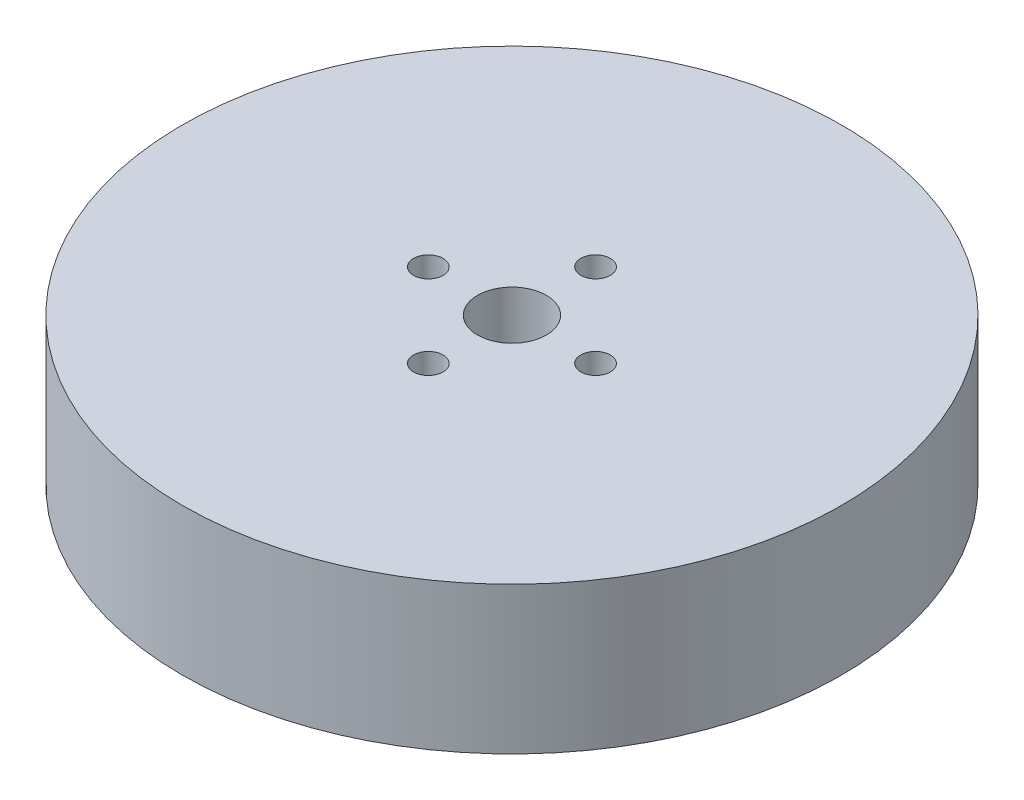
ISO-10303-21;
HEADER;
FILE_DESCRIPTION(('STEP AP214'),'2;1');
FILE_NAME('part.step','',(''),(''),'','','');
FILE_SCHEMA(('AUTOMOTIVE_DESIGN { 1 0 10303 214 1 1 1 1 }'));
ENDSEC;
DATA;
#1=APPLICATION_CONTEXT('core data for automotive mechanical design processes');
#2=APPLICATION_PROTOCOL_DEFINITION('international standard','automotive_design',2000,#1);
#3=PRODUCT_CONTEXT('',#1,'mechanical');
#4=PRODUCT('Part','Part','',(#3));
#5=PRODUCT_RELATED_PRODUCT_CATEGORY('part','',(#4));
#6=PRODUCT_DEFINITION_FORMATION('','',#4);
#7=PRODUCT_DEFINITION_CONTEXT('part definition',#1,'design');
#8=PRODUCT_DEFINITION('design','',#6,#7);
#9=PRODUCT_DEFINITION_SHAPE('','',#8);
#10=(LENGTH_UNIT() NAMED_UNIT(*) SI_UNIT(.MILLI.,.METRE.));
#11=(NAMED_UNIT(*) PLANE_ANGLE_UNIT() SI_UNIT($,.RADIAN.));
#12=(NAMED_UNIT(*) SI_UNIT($,.STERADIAN.) SOLID_ANGLE_UNIT());
#13=UNCERTAINTY_MEASURE_WITH_UNIT(LENGTH_MEASURE(1.E-05),#10,'distance_accuracy_value','');
#14=(GEOMETRIC_REPRESENTATION_CONTEXT(3) GLOBAL_UNCERTAINTY_ASSIGNED_CONTEXT((#13)) GLOBAL_UNIT_ASSIGNED_CONTEXT((#10,
#11,#12)) REPRESENTATION_CONTEXT('',''));
#15=CARTESIAN_POINT('',(0.,0.,0.));
#16=DIRECTION('',(0.,0.,1.));
#17=DIRECTION('',(1.,0.,0.));
#18=AXIS2_PLACEMENT_3D('',#15,#16,#17);
#19=CARTESIAN_POINT('',(0.,17.,0.));
#20=DIRECTION('',(0.,1.,0.));
#21=DIRECTION('',(0.,0.,1.));
#22=AXIS2_PLACEMENT_3D('',#19,#20,#21);
#23=PLANE('',#22);
#24=CARTESIAN_POINT('',(0.,17.,8.5));
#25=DIRECTION('',(0.,1.,0.));
#26=DIRECTION('',(0.,0.,1.));
#27=AXIS2_PLACEMENT_3D('',#24,#25,#26);
#28=CIRCLE('',#27,1.5);
#29=CARTESIAN_POINT('',(0.,17.,10.));
#30=VERTEX_POINT('',#29);
#31=EDGE_CURVE('E55',#30,#30,#28,.F.);
#32=ORIENTED_EDGE('',*,*,#31,.T.);
#33=EDGE_LOOP('',(#32));
#34=FACE_BOUND('',#33,.T.);
#35=CARTESIAN_POINT('',(8.5,17.,0.));
#36=DIRECTION('',(0.,1.,0.));
#37=DIRECTION('',(0.,0.,1.));
#38=AXIS2_PLACEMENT_3D('',#35,#36,#37);
#39=CIRCLE('',#38,1.5);
#40=CARTESIAN_POINT('',(8.5,17.,1.5));
#41=VERTEX_POINT('',#40);
#42=EDGE_CURVE('E63',#41,#41,#39,.F.);
#43=ORIENTED_EDGE('',*,*,#42,.T.);
#44=EDGE_LOOP('',(#43));
#45=FACE_BOUND('',#44,.T.);
#46=CARTESIAN_POINT('',(0.,17.,0.));
#47=DIRECTION('',(0.,1.,0.));
#48=DIRECTION('',(0.,0.,1.));
#49=AXIS2_PLACEMENT_3D('',#46,#47,#48);
#50=CIRCLE('',#49,33.5);
#51=CARTESIAN_POINT('',(0.,17.,33.5));
#52=VERTEX_POINT('',#51);
#53=EDGE_CURVE('E41',#52,#52,#50,.T.);
#54=ORIENTED_EDGE('',*,*,#53,.T.);
#55=EDGE_LOOP('',(#54));
#56=FACE_BOUND('',#55,.T.);
#57=CARTESIAN_POINT('',(0.,17.,0.));
#58=DIRECTION('',(0.,1.,0.));
#59=DIRECTION('',(0.,0.,1.));
#60=AXIS2_PLACEMENT_3D('',#57,#58,#59);
#61=CIRCLE('',#60,3.5);
#62=CARTESIAN_POINT('',(0.,17.,3.5));
#63=VERTEX_POINT('',#62);
#64=EDGE_CURVE('E45',#63,#63,#61,.F.);
#65=ORIENTED_EDGE('',*,*,#64,.T.);
#66=EDGE_LOOP('',(#65));
#67=FACE_BOUND('',#66,.T.);
#68=CARTESIAN_POINT('',(-8.5,17.,0.));
#69=DIRECTION('',(0.,1.,0.));
#70=DIRECTION('',(0.,0.,1.));
#71=AXIS2_PLACEMENT_3D('',#68,#69,#70);
#72=CIRCLE('',#71,1.5);
#73=CARTESIAN_POINT('',(-8.5,17.,1.50000000000001));
#74=VERTEX_POINT('',#73);
#75=EDGE_CURVE('E59',#74,#74,#72,.F.);
#76=ORIENTED_EDGE('',*,*,#75,.T.);
#77=EDGE_LOOP('',(#76));
#78=FACE_BOUND('',#77,.T.);
#79=CARTESIAN_POINT('',(0.,17.,-8.5));
#80=DIRECTION('',(0.,1.,0.));
#81=DIRECTION('',(0.,0.,1.));
#82=AXIS2_PLACEMENT_3D('',#79,#80,#81);
#83=CIRCLE('',#82,1.5);
#84=CARTESIAN_POINT('',(0.,17.,-7.));
#85=VERTEX_POINT('',#84);
#86=EDGE_CURVE('E51',#85,#85,#83,.F.);
#87=ORIENTED_EDGE('',*,*,#86,.T.);
#88=EDGE_LOOP('',(#87));
#89=FACE_BOUND('',#88,.T.);
#90=ADVANCED_FACE('F30',(#34,#45,#56,#67,#78,#89),#23,.T.);
#91=CARTESIAN_POINT('',(0.,0.,0.));
#92=DIRECTION('',(0.,1.,0.));
#93=DIRECTION('',(0.,0.,1.));
#94=AXIS2_PLACEMENT_3D('',#91,#92,#93);
#95=PLANE('',#94);
#96=CARTESIAN_POINT('',(0.,0.,0.));
#97=DIRECTION('',(0.,1.,0.));
#98=DIRECTION('',(0.,0.,1.));
#99=AXIS2_PLACEMENT_3D('',#96,#97,#98);
#100=CIRCLE('',#99,20.4999999999997);
#101=CARTESIAN_POINT('',(0.,0.,20.4999999999997));
#102=VERTEX_POINT('',#101);
#103=EDGE_CURVE('E10',#102,#102,#100,.F.);
#104=ORIENTED_EDGE('',*,*,#103,.T.);
#105=EDGE_LOOP('',(#104));
#106=FACE_BOUND('',#105,.T.);
#107=CARTESIAN_POINT('',(0.,0.,8.5));
#108=DIRECTION('',(0.,1.,0.));
#109=DIRECTION('',(0.,0.,1.));
#110=AXIS2_PLACEMENT_3D('',#107,#108,#109);
#111=CIRCLE('',#110,1.5);
#112=CARTESIAN_POINT('',(0.,0.,10.));
#113=VERTEX_POINT('',#112);
#114=EDGE_CURVE('E52',#113,#113,#111,.F.);
#115=ORIENTED_EDGE('',*,*,#114,.F.);
#116=EDGE_LOOP('',(#115));
#117=FACE_BOUND('',#116,.T.);
#118=CARTESIAN_POINT('',(8.5,0.,0.));
#119=DIRECTION('',(0.,1.,0.));
#120=DIRECTION('',(0.,0.,1.));
#121=AXIS2_PLACEMENT_3D('',#118,#119,#120);
#122=CIRCLE('',#121,1.5);
#123=CARTESIAN_POINT('',(8.5,0.,1.5));
#124=VERTEX_POINT('',#123);
#125=EDGE_CURVE('E60',#124,#124,#122,.F.);
#126=ORIENTED_EDGE('',*,*,#125,.F.);
#127=EDGE_LOOP('',(#126));
#128=FACE_BOUND('',#127,.T.);
#129=CARTESIAN_POINT('',(0.,0.,0.));
#130=DIRECTION('',(0.,1.,0.));
#131=DIRECTION('',(0.,0.,1.));
#132=AXIS2_PLACEMENT_3D('',#129,#130,#131);
#133=CIRCLE('',#132,3.5);
#134=CARTESIAN_POINT('',(0.,0.,3.5));
#135=VERTEX_POINT('',#134);
#136=EDGE_CURVE('E64',#135,#135,#133,.F.);
#137=ORIENTED_EDGE('',*,*,#136,.F.);
#138=EDGE_LOOP('',(#137));
#139=FACE_BOUND('',#138,.T.);
#140=CARTESIAN_POINT('',(-8.5,0.,0.));
#141=DIRECTION('',(0.,1.,0.));
#142=DIRECTION('',(0.,0.,1.));
#143=AXIS2_PLACEMENT_3D('',#140,#141,#142);
#144=CIRCLE('',#143,1.5);
#145=CARTESIAN_POINT('',(-8.5,0.,1.50000000000001));
#146=VERTEX_POINT('',#145);
#147=EDGE_CURVE('E56',#146,#146,#144,.F.);
#148=ORIENTED_EDGE('',*,*,#147,.F.);
#149=EDGE_LOOP('',(#148));
#150=FACE_BOUND('',#149,.T.);
#151=CARTESIAN_POINT('',(0.,0.,-8.5));
#152=DIRECTION('',(0.,1.,0.));
#153=DIRECTION('',(0.,0.,1.));
#154=AXIS2_PLACEMENT_3D('',#151,#152,#153);
#155=CIRCLE('',#154,1.5);
#156=CARTESIAN_POINT('',(0.,0.,-7.));
#157=VERTEX_POINT('',#156);
#158=EDGE_CURVE('E48',#157,#157,#155,.F.);
#159=ORIENTED_EDGE('',*,*,#158,.F.);
#160=EDGE_LOOP('',(#159));
#161=FACE_BOUND('',#160,.T.);
#162=ADVANCED_FACE('F86',(#106,#117,#128,#139,#150,#161),#95,.F.);
#163=CARTESIAN_POINT('',(0.,17.,0.));
#164=DIRECTION('',(0.,-1.,0.));
#165=DIRECTION('',(0.,0.,-1.));
#166=AXIS2_PLACEMENT_3D('',#163,#164,#165);
#167=CYLINDRICAL_SURFACE('',#166,33.5);
#168=CARTESIAN_POINT('',(0.,2.05899772421898,0.));
#169=DIRECTION('',(0.,1.,0.));
#170=DIRECTION('',(0.,0.,1.));
#171=AXIS2_PLACEMENT_3D('',#168,#169,#170);
#172=CIRCLE('',#171,33.5);
#173=CARTESIAN_POINT('',(0.,2.05899772421898,33.5));
#174=VERTEX_POINT('',#173);
#175=EDGE_CURVE('E37',#174,#174,#172,.T.);
#176=ORIENTED_EDGE('',*,*,#175,.T.);
#177=EDGE_LOOP('',(#176));
#178=FACE_BOUND('',#177,.T.);
#179=ORIENTED_EDGE('',*,*,#53,.F.);
#180=EDGE_LOOP('',(#179));
#181=FACE_BOUND('',#180,.T.);
#182=ADVANCED_FACE('F88',(#178,#181),#167,.T.);
#183=CARTESIAN_POINT('',(0.,100.,0.));
#184=DIRECTION('',(0.,-1.,0.));
#185=DIRECTION('',(0.,0.,-1.));
#186=AXIS2_PLACEMENT_3D('',#183,#184,#185);
#187=CYLINDRICAL_SURFACE('',#186,3.5);
#188=ORIENTED_EDGE('',*,*,#64,.F.);
#189=EDGE_LOOP('',(#188));
#190=FACE_BOUND('',#189,.T.);
#191=ORIENTED_EDGE('',*,*,#136,.T.);
#192=EDGE_LOOP('',(#191));
#193=FACE_BOUND('',#192,.T.);
#194=ADVANCED_FACE('F94',(#190,#193),#187,.F.);
#195=CARTESIAN_POINT('',(8.5,100.,0.));
#196=DIRECTION('',(0.,-1.,0.));
#197=DIRECTION('',(0.,0.,-1.));
#198=AXIS2_PLACEMENT_3D('',#195,#196,#197);
#199=CYLINDRICAL_SURFACE('',#198,1.5);
#200=ORIENTED_EDGE('',*,*,#42,.F.);
#201=EDGE_LOOP('',(#200));
#202=FACE_BOUND('',#201,.T.);
#203=ORIENTED_EDGE('',*,*,#125,.T.);
#204=EDGE_LOOP('',(#203));
#205=FACE_BOUND('',#204,.T.);
#206=ADVANCED_FACE('F101',(#202,#205),#199,.F.);
#207=CARTESIAN_POINT('',(-8.5,100.,0.));
#208=DIRECTION('',(0.,-1.,0.));
#209=DIRECTION('',(0.,0.,-1.));
#210=AXIS2_PLACEMENT_3D('',#207,#208,#209);
#211=CYLINDRICAL_SURFACE('',#210,1.5);
#212=ORIENTED_EDGE('',*,*,#75,.F.);
#213=EDGE_LOOP('',(#212));
#214=FACE_BOUND('',#213,.T.);
#215=ORIENTED_EDGE('',*,*,#147,.T.);
#216=EDGE_LOOP('',(#215));
#217=FACE_BOUND('',#216,.T.);
#218=ADVANCED_FACE('F105',(#214,#217),#211,.F.);
#219=CARTESIAN_POINT('',(0.,100.,8.5));
#220=DIRECTION('',(0.,-1.,0.));
#221=DIRECTION('',(0.,0.,-1.));
#222=AXIS2_PLACEMENT_3D('',#219,#220,#221);
#223=CYLINDRICAL_SURFACE('',#222,1.5);
#224=ORIENTED_EDGE('',*,*,#31,.F.);
#225=EDGE_LOOP('',(#224));
#226=FACE_BOUND('',#225,.T.);
#227=ORIENTED_EDGE('',*,*,#114,.T.);
#228=EDGE_LOOP('',(#227));
#229=FACE_BOUND('',#228,.T.);
#230=ADVANCED_FACE('F82',(#226,#229),#223,.F.);
#231=CARTESIAN_POINT('',(0.,100.,-8.5));
#232=DIRECTION('',(0.,-1.,0.));
#233=DIRECTION('',(0.,0.,-1.));
#234=AXIS2_PLACEMENT_3D('',#231,#232,#233);
#235=CYLINDRICAL_SURFACE('',#234,1.5);
#236=ORIENTED_EDGE('',*,*,#86,.F.);
#237=EDGE_LOOP('',(#236));
#238=FACE_BOUND('',#237,.T.);
#239=ORIENTED_EDGE('',*,*,#158,.T.);
#240=EDGE_LOOP('',(#239));
#241=FACE_BOUND('',#240,.T.);
#242=ADVANCED_FACE('F79',(#238,#241),#235,.F.);
#243=CARTESIAN_POINT('',(0.,2.05899772421898,0.));
#244=DIRECTION('',(0.,1.,0.));
#245=DIRECTION('',(0.,0.,1.));
#246=AXIS2_PLACEMENT_3D('',#243,#244,#245);
#247=CONICAL_SURFACE('',#246,33.5,1.41371669411541);
#248=ORIENTED_EDGE('',*,*,#103,.F.);
#249=EDGE_LOOP('',(#248));
#250=FACE_BOUND('',#249,.T.);
#251=ORIENTED_EDGE('',*,*,#175,.F.);
#252=EDGE_LOOP('',(#251));
#253=FACE_BOUND('',#252,.T.);
#254=ADVANCED_FACE('F32',(#250,#253),#247,.T.);
#255=CLOSED_SHELL('',(#90,#162,#182,#194,#206,#218,#230,#242,#254));
#256=MANIFOLD_SOLID_BREP('B2',#255);
#257=ADVANCED_BREP_SHAPE_REPRESENTATION('',(#18,#256),#14);
#258=SHAPE_DEFINITION_REPRESENTATION(#9,#257);
ENDSEC;
END-ISO-10303-21;
